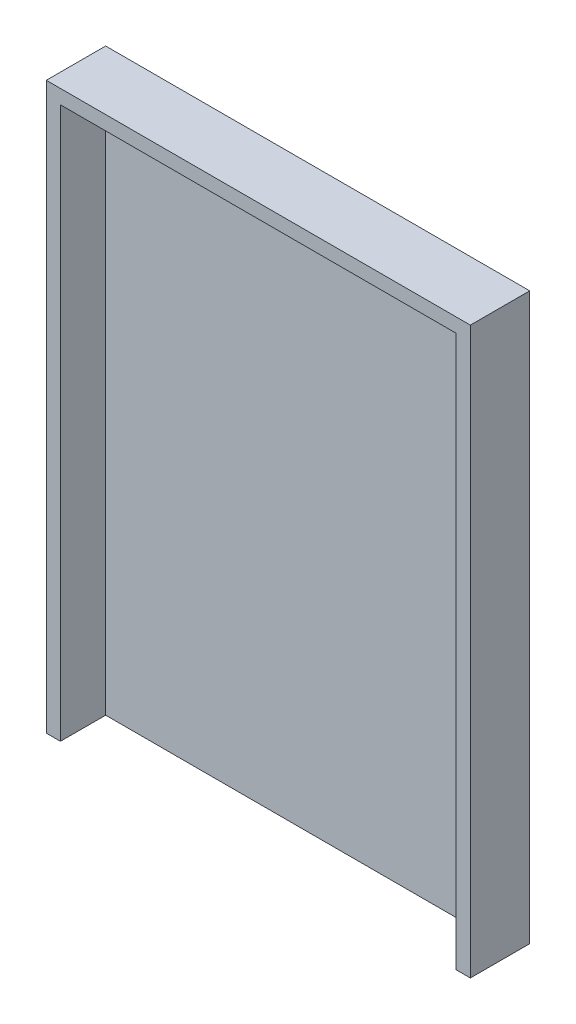
ISO-10303-21;
HEADER;
FILE_DESCRIPTION(('STEP AP214'),'2;1');
FILE_NAME('part.step','',(''),(''),'','','');
FILE_SCHEMA(('AUTOMOTIVE_DESIGN { 1 0 10303 214 1 1 1 1 }'));
ENDSEC;
DATA;
#1=APPLICATION_CONTEXT('core data for automotive mechanical design processes');
#2=APPLICATION_PROTOCOL_DEFINITION('international standard','automotive_design',2000,#1);
#3=PRODUCT_CONTEXT('',#1,'mechanical');
#4=PRODUCT('Part','Part','',(#3));
#5=PRODUCT_RELATED_PRODUCT_CATEGORY('part','',(#4));
#6=PRODUCT_DEFINITION_FORMATION('','',#4);
#7=PRODUCT_DEFINITION_CONTEXT('part definition',#1,'design');
#8=PRODUCT_DEFINITION('design','',#6,#7);
#9=PRODUCT_DEFINITION_SHAPE('','',#8);
#10=(LENGTH_UNIT() NAMED_UNIT(*) SI_UNIT(.MILLI.,.METRE.));
#11=(NAMED_UNIT(*) PLANE_ANGLE_UNIT() SI_UNIT($,.RADIAN.));
#12=(NAMED_UNIT(*) SI_UNIT($,.STERADIAN.) SOLID_ANGLE_UNIT());
#13=UNCERTAINTY_MEASURE_WITH_UNIT(LENGTH_MEASURE(1.E-05),#10,'distance_accuracy_value','');
#14=(GEOMETRIC_REPRESENTATION_CONTEXT(3) GLOBAL_UNCERTAINTY_ASSIGNED_CONTEXT((#13)) GLOBAL_UNIT_ASSIGNED_CONTEXT((#10,
#11,#12)) REPRESENTATION_CONTEXT('',''));
#15=CARTESIAN_POINT('',(0.,0.,0.));
#16=DIRECTION('',(0.,0.,1.));
#17=DIRECTION('',(1.,0.,0.));
#18=AXIS2_PLACEMENT_3D('',#15,#16,#17);
#19=CARTESIAN_POINT('',(0.,0.,10.));
#20=DIRECTION('',(0.,0.,-1.));
#21=DIRECTION('',(-1.,0.,0.));
#22=AXIS2_PLACEMENT_3D('',#19,#20,#21);
#23=PLANE('',#22);
#24=DIRECTION('',(0.,-1.,0.));
#25=VECTOR('',#24,1.);
#26=CARTESIAN_POINT('',(255.046975242196,17.8880516684607,10.));
#27=LINE('',#26,#25);
#28=CARTESIAN_POINT('',(255.046975242196,17.8880516684607,10.));
#29=VERTEX_POINT('',#28);
#30=CARTESIAN_POINT('',(255.046975242196,-372.111948331539,10.));
#31=VERTEX_POINT('',#30);
#32=EDGE_CURVE('E50',#29,#31,#27,.T.);
#33=ORIENTED_EDGE('',*,*,#32,.F.);
#34=DIRECTION('',(1.,0.,0.));
#35=VECTOR('',#34,1.);
#36=CARTESIAN_POINT('',(-24.9530247578041,17.8880516684607,10.));
#37=LINE('',#36,#35);
#38=CARTESIAN_POINT('',(-24.9530247578041,17.8880516684607,10.));
#39=VERTEX_POINT('',#38);
#40=EDGE_CURVE('E121',#39,#29,#37,.T.);
#41=ORIENTED_EDGE('',*,*,#40,.F.);
#42=DIRECTION('',(0.,1.,0.));
#43=VECTOR('',#42,1.);
#44=CARTESIAN_POINT('',(-24.9530247578041,-372.111948331539,10.));
#45=LINE('',#44,#43);
#46=CARTESIAN_POINT('',(-24.9530247578041,-372.111948331539,10.));
#47=VERTEX_POINT('',#46);
#48=EDGE_CURVE('E136',#47,#39,#45,.T.);
#49=ORIENTED_EDGE('',*,*,#48,.F.);
#50=DIRECTION('',(1.,0.,0.));
#51=VECTOR('',#50,1.);
#52=CARTESIAN_POINT('',(265.046975242196,-372.111948331539,10.));
#53=LINE('',#52,#51);
#54=EDGE_CURVE('E55',#47,#31,#53,.T.);
#55=ORIENTED_EDGE('',*,*,#54,.T.);
#56=EDGE_LOOP('',(#33,#41,#49,#55));
#57=FACE_BOUND('',#56,.T.);
#58=ADVANCED_FACE('F35',(#57),#23,.F.);
#59=CARTESIAN_POINT('',(-34.9530247578041,-372.111948331539,10.));
#60=DIRECTION('',(1.,0.,0.));
#61=DIRECTION('',(0.,0.,-1.));
#62=AXIS2_PLACEMENT_3D('',#59,#60,#61);
#63=PLANE('',#62);
#64=DIRECTION('',(0.,-1.,0.));
#65=VECTOR('',#64,1.);
#66=CARTESIAN_POINT('',(-34.9530247578041,-372.111948331539,0.));
#67=LINE('',#66,#65);
#68=CARTESIAN_POINT('',(-34.9530247578041,27.8880516684607,0.));
#69=VERTEX_POINT('',#68);
#70=CARTESIAN_POINT('',(-34.9530247578041,-372.111948331539,0.));
#71=VERTEX_POINT('',#70);
#72=EDGE_CURVE('E150',#69,#71,#67,.T.);
#73=ORIENTED_EDGE('',*,*,#72,.T.);
#74=DIRECTION('',(0.,0.,-1.));
#75=VECTOR('',#74,1.);
#76=CARTESIAN_POINT('',(-34.9530247578041,-372.111948331539,10.));
#77=LINE('',#76,#75);
#78=CARTESIAN_POINT('',(-34.9530247578041,-372.111948331539,42.));
#79=VERTEX_POINT('',#78);
#80=EDGE_CURVE('E11',#79,#71,#77,.T.);
#81=ORIENTED_EDGE('',*,*,#80,.F.);
#82=DIRECTION('',(0.,-1.,0.));
#83=VECTOR('',#82,1.);
#84=CARTESIAN_POINT('',(-34.9530247578041,27.8880516684607,42.));
#85=LINE('',#84,#83);
#86=CARTESIAN_POINT('',(-34.9530247578041,27.8880516684607,42.));
#87=VERTEX_POINT('',#86);
#88=EDGE_CURVE('E125',#87,#79,#85,.T.);
#89=ORIENTED_EDGE('',*,*,#88,.F.);
#90=DIRECTION('',(0.,0.,-1.));
#91=VECTOR('',#90,1.);
#92=CARTESIAN_POINT('',(-34.9530247578041,27.8880516684607,10.));
#93=LINE('',#92,#91);
#94=EDGE_CURVE('E152',#87,#69,#93,.T.);
#95=ORIENTED_EDGE('',*,*,#94,.T.);
#96=EDGE_LOOP('',(#73,#81,#89,#95));
#97=FACE_BOUND('',#96,.T.);
#98=ADVANCED_FACE('F37',(#97),#63,.F.);
#99=CARTESIAN_POINT('',(265.046975242196,-372.111948331539,10.));
#100=DIRECTION('',(0.,1.,0.));
#101=DIRECTION('',(0.,0.,1.));
#102=AXIS2_PLACEMENT_3D('',#99,#100,#101);
#103=PLANE('',#102);
#104=DIRECTION('',(1.,0.,0.));
#105=VECTOR('',#104,1.);
#106=CARTESIAN_POINT('',(265.046975242196,-372.111948331539,0.));
#107=LINE('',#106,#105);
#108=CARTESIAN_POINT('',(265.046975242196,-372.111948331539,0.));
#109=VERTEX_POINT('',#108);
#110=EDGE_CURVE('E103',#71,#109,#107,.T.);
#111=ORIENTED_EDGE('',*,*,#110,.T.);
#112=DIRECTION('',(0.,0.,-1.));
#113=VECTOR('',#112,1.);
#114=CARTESIAN_POINT('',(265.046975242196,-372.111948331539,10.));
#115=LINE('',#114,#113);
#116=CARTESIAN_POINT('',(265.046975242196,-372.111948331539,42.));
#117=VERTEX_POINT('',#116);
#118=EDGE_CURVE('E43',#117,#109,#115,.T.);
#119=ORIENTED_EDGE('',*,*,#118,.F.);
#120=DIRECTION('',(1.,0.,0.));
#121=VECTOR('',#120,1.);
#122=CARTESIAN_POINT('',(255.046975242196,-372.111948331539,42.));
#123=LINE('',#122,#121);
#124=CARTESIAN_POINT('',(255.046975242196,-372.111948331539,42.));
#125=VERTEX_POINT('',#124);
#126=EDGE_CURVE('E102',#125,#117,#123,.T.);
#127=ORIENTED_EDGE('',*,*,#126,.F.);
#128=DIRECTION('',(0.,0.,-1.));
#129=VECTOR('',#128,1.);
#130=CARTESIAN_POINT('',(255.046975242196,-372.111948331539,42.));
#131=LINE('',#130,#129);
#132=EDGE_CURVE('E135',#125,#31,#131,.T.);
#133=ORIENTED_EDGE('',*,*,#132,.T.);
#134=ORIENTED_EDGE('',*,*,#54,.F.);
#135=DIRECTION('',(0.,0.,-1.));
#136=VECTOR('',#135,1.);
#137=CARTESIAN_POINT('',(-24.9530247578041,-372.111948331539,42.));
#138=LINE('',#137,#136);
#139=CARTESIAN_POINT('',(-24.9530247578041,-372.111948331539,42.));
#140=VERTEX_POINT('',#139);
#141=EDGE_CURVE('E147',#140,#47,#138,.T.);
#142=ORIENTED_EDGE('',*,*,#141,.F.);
#143=DIRECTION('',(1.,0.,0.));
#144=VECTOR('',#143,1.);
#145=CARTESIAN_POINT('',(-34.9530247578041,-372.111948331539,42.));
#146=LINE('',#145,#144);
#147=EDGE_CURVE('E128',#79,#140,#146,.T.);
#148=ORIENTED_EDGE('',*,*,#147,.F.);
#149=ORIENTED_EDGE('',*,*,#80,.T.);
#150=EDGE_LOOP('',(#111,#119,#127,#133,#134,#142,#148,#149));
#151=FACE_BOUND('',#150,.T.);
#152=ADVANCED_FACE('F99',(#151),#103,.F.);
#153=CARTESIAN_POINT('',(265.046975242196,27.8880516684607,10.));
#154=DIRECTION('',(-1.,0.,0.));
#155=DIRECTION('',(0.,0.,1.));
#156=AXIS2_PLACEMENT_3D('',#153,#154,#155);
#157=PLANE('',#156);
#158=DIRECTION('',(0.,1.,0.));
#159=VECTOR('',#158,1.);
#160=CARTESIAN_POINT('',(265.046975242196,27.8880516684607,0.));
#161=LINE('',#160,#159);
#162=CARTESIAN_POINT('',(265.046975242196,27.8880516684607,0.));
#163=VERTEX_POINT('',#162);
#164=EDGE_CURVE('E157',#109,#163,#161,.T.);
#165=ORIENTED_EDGE('',*,*,#164,.T.);
#166=DIRECTION('',(0.,0.,-1.));
#167=VECTOR('',#166,1.);
#168=CARTESIAN_POINT('',(265.046975242196,27.8880516684607,10.));
#169=LINE('',#168,#167);
#170=CARTESIAN_POINT('',(265.046975242196,27.8880516684607,42.));
#171=VERTEX_POINT('',#170);
#172=EDGE_CURVE('E106',#171,#163,#169,.T.);
#173=ORIENTED_EDGE('',*,*,#172,.F.);
#174=DIRECTION('',(0.,1.,0.));
#175=VECTOR('',#174,1.);
#176=CARTESIAN_POINT('',(265.046975242196,-372.111948331539,42.));
#177=LINE('',#176,#175);
#178=EDGE_CURVE('E108',#117,#171,#177,.T.);
#179=ORIENTED_EDGE('',*,*,#178,.F.);
#180=ORIENTED_EDGE('',*,*,#118,.T.);
#181=EDGE_LOOP('',(#165,#173,#179,#180));
#182=FACE_BOUND('',#181,.T.);
#183=ADVANCED_FACE('F109',(#182),#157,.F.);
#184=CARTESIAN_POINT('',(-34.9530247578041,27.8880516684607,10.));
#185=DIRECTION('',(0.,-1.,0.));
#186=DIRECTION('',(0.,0.,-1.));
#187=AXIS2_PLACEMENT_3D('',#184,#185,#186);
#188=PLANE('',#187);
#189=DIRECTION('',(-1.,0.,0.));
#190=VECTOR('',#189,1.);
#191=CARTESIAN_POINT('',(-34.9530247578041,27.8880516684607,0.));
#192=LINE('',#191,#190);
#193=EDGE_CURVE('E153',#163,#69,#192,.T.);
#194=ORIENTED_EDGE('',*,*,#193,.T.);
#195=ORIENTED_EDGE('',*,*,#94,.F.);
#196=DIRECTION('',(-1.,0.,0.));
#197=VECTOR('',#196,1.);
#198=CARTESIAN_POINT('',(265.046975242196,27.8880516684607,42.));
#199=LINE('',#198,#197);
#200=EDGE_CURVE('E114',#171,#87,#199,.T.);
#201=ORIENTED_EDGE('',*,*,#200,.F.);
#202=ORIENTED_EDGE('',*,*,#172,.T.);
#203=EDGE_LOOP('',(#194,#195,#201,#202));
#204=FACE_BOUND('',#203,.T.);
#205=ADVANCED_FACE('F164',(#204),#188,.F.);
#206=CARTESIAN_POINT('',(0.,0.,0.));
#207=DIRECTION('',(0.,0.,-1.));
#208=DIRECTION('',(-1.,0.,0.));
#209=AXIS2_PLACEMENT_3D('',#206,#207,#208);
#210=PLANE('',#209);
#211=ORIENTED_EDGE('',*,*,#72,.F.);
#212=ORIENTED_EDGE('',*,*,#193,.F.);
#213=ORIENTED_EDGE('',*,*,#164,.F.);
#214=ORIENTED_EDGE('',*,*,#110,.F.);
#215=EDGE_LOOP('',(#211,#212,#213,#214));
#216=FACE_BOUND('',#215,.T.);
#217=ADVANCED_FACE('F167',(#216),#210,.T.);
#218=CARTESIAN_POINT('',(-24.9530247578041,-372.111948331539,42.));
#219=DIRECTION('',(-1.,0.,0.));
#220=DIRECTION('',(0.,0.,1.));
#221=AXIS2_PLACEMENT_3D('',#218,#219,#220);
#222=PLANE('',#221);
#223=ORIENTED_EDGE('',*,*,#48,.T.);
#224=DIRECTION('',(0.,0.,-1.));
#225=VECTOR('',#224,1.);
#226=CARTESIAN_POINT('',(-24.9530247578041,17.8880516684607,42.));
#227=LINE('',#226,#225);
#228=CARTESIAN_POINT('',(-24.9530247578041,17.8880516684607,42.));
#229=VERTEX_POINT('',#228);
#230=EDGE_CURVE('E144',#229,#39,#227,.T.);
#231=ORIENTED_EDGE('',*,*,#230,.F.);
#232=DIRECTION('',(0.,1.,0.));
#233=VECTOR('',#232,1.);
#234=CARTESIAN_POINT('',(-24.9530247578041,-372.111948331539,42.));
#235=LINE('',#234,#233);
#236=EDGE_CURVE('E130',#140,#229,#235,.T.);
#237=ORIENTED_EDGE('',*,*,#236,.F.);
#238=ORIENTED_EDGE('',*,*,#141,.T.);
#239=EDGE_LOOP('',(#223,#231,#237,#238));
#240=FACE_BOUND('',#239,.T.);
#241=ADVANCED_FACE('F175',(#240),#222,.F.);
#242=CARTESIAN_POINT('',(-24.9530247578041,17.8880516684607,42.));
#243=DIRECTION('',(0.,1.,0.));
#244=DIRECTION('',(0.,0.,1.));
#245=AXIS2_PLACEMENT_3D('',#242,#243,#244);
#246=PLANE('',#245);
#247=ORIENTED_EDGE('',*,*,#40,.T.);
#248=DIRECTION('',(0.,0.,-1.));
#249=VECTOR('',#248,1.);
#250=CARTESIAN_POINT('',(255.046975242196,17.8880516684607,42.));
#251=LINE('',#250,#249);
#252=CARTESIAN_POINT('',(255.046975242196,17.8880516684607,42.));
#253=VERTEX_POINT('',#252);
#254=EDGE_CURVE('E141',#253,#29,#251,.T.);
#255=ORIENTED_EDGE('',*,*,#254,.F.);
#256=DIRECTION('',(1.,0.,0.));
#257=VECTOR('',#256,1.);
#258=CARTESIAN_POINT('',(-24.9530247578041,17.8880516684607,42.));
#259=LINE('',#258,#257);
#260=EDGE_CURVE('E132',#229,#253,#259,.T.);
#261=ORIENTED_EDGE('',*,*,#260,.F.);
#262=ORIENTED_EDGE('',*,*,#230,.T.);
#263=EDGE_LOOP('',(#247,#255,#261,#262));
#264=FACE_BOUND('',#263,.T.);
#265=ADVANCED_FACE('F179',(#264),#246,.F.);
#266=CARTESIAN_POINT('',(255.046975242196,17.8880516684607,42.));
#267=DIRECTION('',(1.,0.,0.));
#268=DIRECTION('',(0.,1.,0.));
#269=AXIS2_PLACEMENT_3D('',#266,#267,#268);
#270=PLANE('',#269);
#271=ORIENTED_EDGE('',*,*,#32,.T.);
#272=ORIENTED_EDGE('',*,*,#132,.F.);
#273=DIRECTION('',(0.,-1.,0.));
#274=VECTOR('',#273,1.);
#275=CARTESIAN_POINT('',(255.046975242196,17.8880516684607,42.));
#276=LINE('',#275,#274);
#277=EDGE_CURVE('E118',#253,#125,#276,.T.);
#278=ORIENTED_EDGE('',*,*,#277,.F.);
#279=ORIENTED_EDGE('',*,*,#254,.T.);
#280=EDGE_LOOP('',(#271,#272,#278,#279));
#281=FACE_BOUND('',#280,.T.);
#282=ADVANCED_FACE('F181',(#281),#270,.F.);
#283=CARTESIAN_POINT('',(0.,0.,42.));
#284=DIRECTION('',(0.,0.,1.));
#285=DIRECTION('',(1.,0.,0.));
#286=AXIS2_PLACEMENT_3D('',#283,#284,#285);
#287=PLANE('',#286);
#288=ORIENTED_EDGE('',*,*,#126,.T.);
#289=ORIENTED_EDGE('',*,*,#178,.T.);
#290=ORIENTED_EDGE('',*,*,#200,.T.);
#291=ORIENTED_EDGE('',*,*,#88,.T.);
#292=ORIENTED_EDGE('',*,*,#147,.T.);
#293=ORIENTED_EDGE('',*,*,#236,.T.);
#294=ORIENTED_EDGE('',*,*,#260,.T.);
#295=ORIENTED_EDGE('',*,*,#277,.T.);
#296=EDGE_LOOP('',(#288,#289,#290,#291,#292,#293,#294,#295));
#297=FACE_BOUND('',#296,.T.);
#298=ADVANCED_FACE('F116',(#297),#287,.T.);
#299=CLOSED_SHELL('',(#58,#98,#152,#183,#205,#217,#241,#265,#282,#298));
#300=MANIFOLD_SOLID_BREP('B2',#299);
#301=ADVANCED_BREP_SHAPE_REPRESENTATION('',(#18,#300),#14);
#302=SHAPE_DEFINITION_REPRESENTATION(#9,#301);
ENDSEC;
END-ISO-10303-21;
